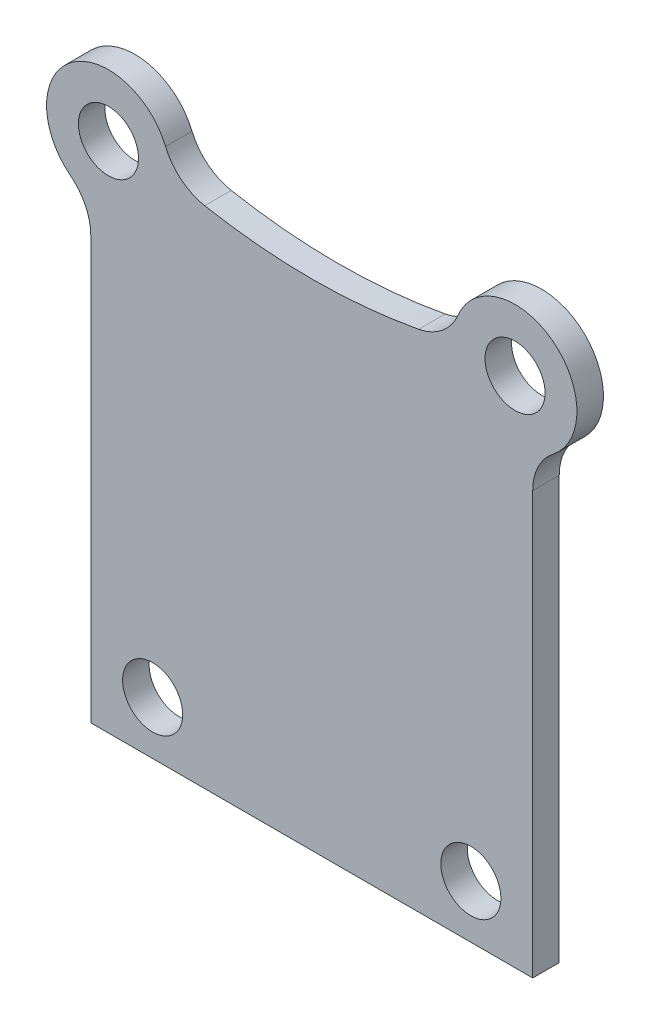
ISO-10303-21;
HEADER;
FILE_DESCRIPTION(('STEP AP214'),'2;1');
FILE_NAME('part.step','',(''),(''),'','','');
FILE_SCHEMA(('AUTOMOTIVE_DESIGN { 1 0 10303 214 1 1 1 1 }'));
ENDSEC;
DATA;
#1=APPLICATION_CONTEXT('core data for automotive mechanical design processes');
#2=APPLICATION_PROTOCOL_DEFINITION('international standard','automotive_design',2000,#1);
#3=PRODUCT_CONTEXT('',#1,'mechanical');
#4=PRODUCT('Part','Part','',(#3));
#5=PRODUCT_RELATED_PRODUCT_CATEGORY('part','',(#4));
#6=PRODUCT_DEFINITION_FORMATION('','',#4);
#7=PRODUCT_DEFINITION_CONTEXT('part definition',#1,'design');
#8=PRODUCT_DEFINITION('design','',#6,#7);
#9=PRODUCT_DEFINITION_SHAPE('','',#8);
#10=(LENGTH_UNIT() NAMED_UNIT(*) SI_UNIT(.MILLI.,.METRE.));
#11=(NAMED_UNIT(*) PLANE_ANGLE_UNIT() SI_UNIT($,.RADIAN.));
#12=(NAMED_UNIT(*) SI_UNIT($,.STERADIAN.) SOLID_ANGLE_UNIT());
#13=UNCERTAINTY_MEASURE_WITH_UNIT(LENGTH_MEASURE(1.E-05),#10,'distance_accuracy_value','');
#14=(GEOMETRIC_REPRESENTATION_CONTEXT(3) GLOBAL_UNCERTAINTY_ASSIGNED_CONTEXT((#13)) GLOBAL_UNIT_ASSIGNED_CONTEXT((#10,
#11,#12)) REPRESENTATION_CONTEXT('',''));
#15=CARTESIAN_POINT('',(0.,0.,0.));
#16=DIRECTION('',(0.,0.,1.));
#17=DIRECTION('',(1.,0.,0.));
#18=AXIS2_PLACEMENT_3D('',#15,#16,#17);
#19=CARTESIAN_POINT('',(-15.5,-56.1234753829798,-1.5));
#20=DIRECTION('',(0.,0.,1.));
#21=DIRECTION('',(1.,0.,0.));
#22=AXIS2_PLACEMENT_3D('',#19,#20,#21);
#23=CYLINDRICAL_SURFACE('',#22,3.);
#24=CARTESIAN_POINT('',(-15.5,-56.1234753829798,0.));
#25=DIRECTION('',(0.,0.,-1.));
#26=DIRECTION('',(1.,0.,0.));
#27=AXIS2_PLACEMENT_3D('',#24,#25,#26);
#28=CIRCLE('',#27,3.);
#29=CARTESIAN_POINT('',(-13.6538461538462,-53.7587944369891,0.));
#30=VERTEX_POINT('',#29);
#31=CARTESIAN_POINT('',(-12.5,-56.1234753829798,0.));
#32=VERTEX_POINT('',#31);
#33=EDGE_CURVE('E144',#30,#32,#28,.T.);
#34=ORIENTED_EDGE('',*,*,#33,.F.);
#35=DIRECTION('',(0.,0.,1.));
#36=VECTOR('',#35,1.);
#37=CARTESIAN_POINT('',(-13.6538461538462,-53.7587944369891,-1.5));
#38=LINE('',#37,#36);
#39=CARTESIAN_POINT('',(-13.6538461538462,-53.7587944369891,-1.5));
#40=VERTEX_POINT('',#39);
#41=EDGE_CURVE('E11',#40,#30,#38,.T.);
#42=ORIENTED_EDGE('',*,*,#41,.F.);
#43=CARTESIAN_POINT('',(-15.5,-56.1234753829798,-1.5));
#44=DIRECTION('',(0.,0.,-1.));
#45=DIRECTION('',(1.,0.,0.));
#46=AXIS2_PLACEMENT_3D('',#43,#44,#45);
#47=CIRCLE('',#46,3.);
#48=CARTESIAN_POINT('',(-12.5,-56.1234753829798,-1.5));
#49=VERTEX_POINT('',#48);
#50=EDGE_CURVE('E171',#40,#49,#47,.T.);
#51=ORIENTED_EDGE('',*,*,#50,.T.);
#52=DIRECTION('',(0.,0.,1.));
#53=VECTOR('',#52,1.);
#54=CARTESIAN_POINT('',(-12.5,-56.1234753829798,-1.5));
#55=LINE('',#54,#53);
#56=EDGE_CURVE('E38',#49,#32,#55,.T.);
#57=ORIENTED_EDGE('',*,*,#56,.T.);
#58=EDGE_LOOP('',(#34,#42,#51,#57));
#59=FACE_BOUND('',#58,.T.);
#60=ADVANCED_FACE('F35',(#59),#23,.F.);
#61=CARTESIAN_POINT('',(-11.5,-51.,-1.5));
#62=DIRECTION('',(0.,0.,1.));
#63=DIRECTION('',(1.,0.,0.));
#64=AXIS2_PLACEMENT_3D('',#61,#62,#63);
#65=CYLINDRICAL_SURFACE('',#64,3.50000000000001);
#66=CARTESIAN_POINT('',(-11.5,-51.,0.));
#67=DIRECTION('',(0.,0.,1.));
#68=DIRECTION('',(1.,0.,0.));
#69=AXIS2_PLACEMENT_3D('',#66,#67,#68);
#70=CIRCLE('',#69,3.50000000000001);
#71=CARTESIAN_POINT('',(-8.27038440674473,-49.6510807586062,0.));
#72=VERTEX_POINT('',#71);
#73=EDGE_CURVE('E169',#72,#30,#70,.T.);
#74=ORIENTED_EDGE('',*,*,#73,.F.);
#75=DIRECTION('',(0.,0.,1.));
#76=VECTOR('',#75,1.);
#77=CARTESIAN_POINT('',(-8.27038440674473,-49.6510807586062,-1.5));
#78=LINE('',#77,#76);
#79=CARTESIAN_POINT('',(-8.27038440674473,-49.6510807586062,-1.5));
#80=VERTEX_POINT('',#79);
#81=EDGE_CURVE('E44',#80,#72,#78,.T.);
#82=ORIENTED_EDGE('',*,*,#81,.F.);
#83=CARTESIAN_POINT('',(-11.5,-51.,-1.5));
#84=DIRECTION('',(0.,0.,1.));
#85=DIRECTION('',(1.,0.,0.));
#86=AXIS2_PLACEMENT_3D('',#83,#84,#85);
#87=CIRCLE('',#86,3.50000000000001);
#88=EDGE_CURVE('E134',#80,#40,#87,.T.);
#89=ORIENTED_EDGE('',*,*,#88,.T.);
#90=ORIENTED_EDGE('',*,*,#41,.T.);
#91=EDGE_LOOP('',(#74,#82,#89,#90));
#92=FACE_BOUND('',#91,.T.);
#93=ADVANCED_FACE('F187',(#92),#65,.T.);
#94=CARTESIAN_POINT('',(-5.50214246966879,-48.494864265983,-1.5));
#95=DIRECTION('',(0.,0.,1.));
#96=DIRECTION('',(1.,0.,0.));
#97=AXIS2_PLACEMENT_3D('',#94,#95,#96);
#98=CYLINDRICAL_SURFACE('',#97,3.);
#99=CARTESIAN_POINT('',(-5.50214246966879,-48.494864265983,0.));
#100=DIRECTION('',(0.,0.,-1.));
#101=DIRECTION('',(1.,0.,0.));
#102=AXIS2_PLACEMENT_3D('',#99,#100,#101);
#103=CIRCLE('',#102,3.);
#104=CARTESIAN_POINT('',(-6.05228930032564,-51.4439892997376,0.));
#105=VERTEX_POINT('',#104);
#106=EDGE_CURVE('E121',#105,#72,#103,.T.);
#107=ORIENTED_EDGE('',*,*,#106,.F.);
#108=DIRECTION('',(0.,0.,1.));
#109=VECTOR('',#108,1.);
#110=CARTESIAN_POINT('',(-6.05228930032564,-51.4439892997376,-1.5));
#111=LINE('',#110,#109);
#112=CARTESIAN_POINT('',(-6.05228930032564,-51.4439892997376,-1.5));
#113=VERTEX_POINT('',#112);
#114=EDGE_CURVE('E116',#113,#105,#111,.T.);
#115=ORIENTED_EDGE('',*,*,#114,.F.);
#116=CARTESIAN_POINT('',(-5.50214246966879,-48.494864265983,-1.5));
#117=DIRECTION('',(0.,0.,-1.));
#118=DIRECTION('',(1.,0.,0.));
#119=AXIS2_PLACEMENT_3D('',#116,#117,#118);
#120=CIRCLE('',#119,3.);
#121=EDGE_CURVE('E119',#113,#80,#120,.T.);
#122=ORIENTED_EDGE('',*,*,#121,.T.);
#123=ORIENTED_EDGE('',*,*,#81,.T.);
#124=EDGE_LOOP('',(#107,#115,#122,#123));
#125=FACE_BOUND('',#124,.T.);
#126=ADVANCED_FACE('F118',(#125),#98,.F.);
#127=CARTESIAN_POINT('',(0.,-19.,-1.5));
#128=DIRECTION('',(0.,0.,1.));
#129=DIRECTION('',(1.,0.,0.));
#130=AXIS2_PLACEMENT_3D('',#127,#128,#129);
#131=CYLINDRICAL_SURFACE('',#130,33.0036762718386);
#132=CARTESIAN_POINT('',(0.,-19.,0.));
#133=DIRECTION('',(0.,0.,-1.));
#134=DIRECTION('',(1.,0.,0.));
#135=AXIS2_PLACEMENT_3D('',#132,#133,#134);
#136=CIRCLE('',#135,33.0036762718386);
#137=CARTESIAN_POINT('',(6.05228930032564,-51.4439892997376,0.));
#138=VERTEX_POINT('',#137);
#139=EDGE_CURVE('E166',#138,#105,#136,.T.);
#140=ORIENTED_EDGE('',*,*,#139,.F.);
#141=DIRECTION('',(0.,0.,1.));
#142=VECTOR('',#141,1.);
#143=CARTESIAN_POINT('',(6.05228930032564,-51.4439892997376,-1.5));
#144=LINE('',#143,#142);
#145=CARTESIAN_POINT('',(6.05228930032564,-51.4439892997376,-1.5));
#146=VERTEX_POINT('',#145);
#147=EDGE_CURVE('E126',#146,#138,#144,.T.);
#148=ORIENTED_EDGE('',*,*,#147,.F.);
#149=CARTESIAN_POINT('',(0.,-19.,-1.5));
#150=DIRECTION('',(0.,0.,-1.));
#151=DIRECTION('',(1.,0.,0.));
#152=AXIS2_PLACEMENT_3D('',#149,#150,#151);
#153=CIRCLE('',#152,33.0036762718386);
#154=EDGE_CURVE('E132',#146,#113,#153,.T.);
#155=ORIENTED_EDGE('',*,*,#154,.T.);
#156=ORIENTED_EDGE('',*,*,#114,.T.);
#157=EDGE_LOOP('',(#140,#148,#155,#156));
#158=FACE_BOUND('',#157,.T.);
#159=ADVANCED_FACE('F136',(#158),#131,.F.);
#160=CARTESIAN_POINT('',(5.50214246966878,-48.494864265983,-1.5));
#161=DIRECTION('',(0.,0.,1.));
#162=DIRECTION('',(1.,0.,0.));
#163=AXIS2_PLACEMENT_3D('',#160,#161,#162);
#164=CYLINDRICAL_SURFACE('',#163,3.);
#165=CARTESIAN_POINT('',(5.50214246966878,-48.494864265983,0.));
#166=DIRECTION('',(0.,0.,-1.));
#167=DIRECTION('',(1.,0.,0.));
#168=AXIS2_PLACEMENT_3D('',#165,#166,#167);
#169=CIRCLE('',#168,3.);
#170=CARTESIAN_POINT('',(8.27038440674472,-49.6510807586062,0.));
#171=VERTEX_POINT('',#170);
#172=EDGE_CURVE('E163',#171,#138,#169,.T.);
#173=ORIENTED_EDGE('',*,*,#172,.F.);
#174=DIRECTION('',(0.,0.,1.));
#175=VECTOR('',#174,1.);
#176=CARTESIAN_POINT('',(8.27038440674472,-49.6510807586062,-1.5));
#177=LINE('',#176,#175);
#178=CARTESIAN_POINT('',(8.27038440674472,-49.6510807586062,-1.5));
#179=VERTEX_POINT('',#178);
#180=EDGE_CURVE('E175',#179,#171,#177,.T.);
#181=ORIENTED_EDGE('',*,*,#180,.F.);
#182=CARTESIAN_POINT('',(5.50214246966878,-48.494864265983,-1.5));
#183=DIRECTION('',(0.,0.,-1.));
#184=DIRECTION('',(1.,0.,0.));
#185=AXIS2_PLACEMENT_3D('',#182,#183,#184);
#186=CIRCLE('',#185,3.);
#187=EDGE_CURVE('E137',#179,#146,#186,.T.);
#188=ORIENTED_EDGE('',*,*,#187,.T.);
#189=ORIENTED_EDGE('',*,*,#147,.T.);
#190=EDGE_LOOP('',(#173,#181,#188,#189));
#191=FACE_BOUND('',#190,.T.);
#192=ADVANCED_FACE('F200',(#191),#164,.F.);
#193=CARTESIAN_POINT('',(11.5,-51.,-1.5));
#194=DIRECTION('',(0.,0.,1.));
#195=DIRECTION('',(1.,0.,0.));
#196=AXIS2_PLACEMENT_3D('',#193,#194,#195);
#197=CYLINDRICAL_SURFACE('',#196,3.5);
#198=CARTESIAN_POINT('',(11.5,-51.,0.));
#199=DIRECTION('',(0.,0.,1.));
#200=DIRECTION('',(1.,0.,0.));
#201=AXIS2_PLACEMENT_3D('',#198,#199,#200);
#202=CIRCLE('',#201,3.5);
#203=CARTESIAN_POINT('',(13.6538461538462,-53.7587944369891,0.));
#204=VERTEX_POINT('',#203);
#205=EDGE_CURVE('E160',#204,#171,#202,.T.);
#206=ORIENTED_EDGE('',*,*,#205,.F.);
#207=DIRECTION('',(0.,0.,1.));
#208=VECTOR('',#207,1.);
#209=CARTESIAN_POINT('',(13.6538461538462,-53.7587944369891,-1.5));
#210=LINE('',#209,#208);
#211=CARTESIAN_POINT('',(13.6538461538462,-53.7587944369891,-1.5));
#212=VERTEX_POINT('',#211);
#213=EDGE_CURVE('E177',#212,#204,#210,.T.);
#214=ORIENTED_EDGE('',*,*,#213,.F.);
#215=CARTESIAN_POINT('',(11.5,-51.,-1.5));
#216=DIRECTION('',(0.,0.,1.));
#217=DIRECTION('',(1.,0.,0.));
#218=AXIS2_PLACEMENT_3D('',#215,#216,#217);
#219=CIRCLE('',#218,3.5);
#220=EDGE_CURVE('E139',#212,#179,#219,.T.);
#221=ORIENTED_EDGE('',*,*,#220,.T.);
#222=ORIENTED_EDGE('',*,*,#180,.T.);
#223=EDGE_LOOP('',(#206,#214,#221,#222));
#224=FACE_BOUND('',#223,.T.);
#225=ADVANCED_FACE('F203',(#224),#197,.T.);
#226=CARTESIAN_POINT('',(15.5,-56.1234753829798,-1.5));
#227=DIRECTION('',(0.,0.,1.));
#228=DIRECTION('',(1.,0.,0.));
#229=AXIS2_PLACEMENT_3D('',#226,#227,#228);
#230=CYLINDRICAL_SURFACE('',#229,3.);
#231=CARTESIAN_POINT('',(15.5,-56.1234753829798,0.));
#232=DIRECTION('',(0.,0.,-1.));
#233=DIRECTION('',(1.,0.,0.));
#234=AXIS2_PLACEMENT_3D('',#231,#232,#233);
#235=CIRCLE('',#234,3.);
#236=CARTESIAN_POINT('',(12.5,-56.1234753829798,0.));
#237=VERTEX_POINT('',#236);
#238=EDGE_CURVE('E157',#237,#204,#235,.T.);
#239=ORIENTED_EDGE('',*,*,#238,.F.);
#240=DIRECTION('',(0.,0.,1.));
#241=VECTOR('',#240,1.);
#242=CARTESIAN_POINT('',(12.5,-56.1234753829798,-1.5));
#243=LINE('',#242,#241);
#244=CARTESIAN_POINT('',(12.5,-56.1234753829798,-1.5));
#245=VERTEX_POINT('',#244);
#246=EDGE_CURVE('E179',#245,#237,#243,.T.);
#247=ORIENTED_EDGE('',*,*,#246,.F.);
#248=CARTESIAN_POINT('',(15.5,-56.1234753829798,-1.5));
#249=DIRECTION('',(0.,0.,-1.));
#250=DIRECTION('',(1.,0.,0.));
#251=AXIS2_PLACEMENT_3D('',#248,#249,#250);
#252=CIRCLE('',#251,3.);
#253=EDGE_CURVE('E283',#245,#212,#252,.T.);
#254=ORIENTED_EDGE('',*,*,#253,.T.);
#255=ORIENTED_EDGE('',*,*,#213,.T.);
#256=EDGE_LOOP('',(#239,#247,#254,#255));
#257=FACE_BOUND('',#256,.T.);
#258=ADVANCED_FACE('F207',(#257),#230,.F.);
#259=CARTESIAN_POINT('',(12.5,-80.,-1.5));
#260=DIRECTION('',(1.,0.,0.));
#261=DIRECTION('',(0.,1.,0.));
#262=AXIS2_PLACEMENT_3D('',#259,#260,#261);
#263=PLANE('',#262);
#264=DIRECTION('',(0.,1.,0.));
#265=VECTOR('',#264,1.);
#266=CARTESIAN_POINT('',(12.5,-80.,0.));
#267=LINE('',#266,#265);
#268=CARTESIAN_POINT('',(12.5,-80.,0.));
#269=VERTEX_POINT('',#268);
#270=EDGE_CURVE('E154',#269,#237,#267,.T.);
#271=ORIENTED_EDGE('',*,*,#270,.F.);
#272=DIRECTION('',(0.,0.,1.));
#273=VECTOR('',#272,1.);
#274=CARTESIAN_POINT('',(12.5,-80.,-1.5));
#275=LINE('',#274,#273);
#276=CARTESIAN_POINT('',(12.5,-80.,-1.5));
#277=VERTEX_POINT('',#276);
#278=EDGE_CURVE('E181',#277,#269,#275,.T.);
#279=ORIENTED_EDGE('',*,*,#278,.F.);
#280=DIRECTION('',(0.,1.,0.));
#281=VECTOR('',#280,1.);
#282=CARTESIAN_POINT('',(12.5,-80.,-1.5));
#283=LINE('',#282,#281);
#284=EDGE_CURVE('E280',#277,#245,#283,.T.);
#285=ORIENTED_EDGE('',*,*,#284,.T.);
#286=ORIENTED_EDGE('',*,*,#246,.T.);
#287=EDGE_LOOP('',(#271,#279,#285,#286));
#288=FACE_BOUND('',#287,.T.);
#289=ADVANCED_FACE('F211',(#288),#263,.T.);
#290=CARTESIAN_POINT('',(-12.5,-80.,-1.5));
#291=DIRECTION('',(0.,-1.,0.));
#292=DIRECTION('',(0.,0.,-1.));
#293=AXIS2_PLACEMENT_3D('',#290,#291,#292);
#294=PLANE('',#293);
#295=DIRECTION('',(1.,0.,0.));
#296=VECTOR('',#295,1.);
#297=CARTESIAN_POINT('',(-12.5,-80.,0.));
#298=LINE('',#297,#296);
#299=CARTESIAN_POINT('',(-12.5,-80.,0.));
#300=VERTEX_POINT('',#299);
#301=EDGE_CURVE('E151',#300,#269,#298,.T.);
#302=ORIENTED_EDGE('',*,*,#301,.F.);
#303=DIRECTION('',(0.,0.,1.));
#304=VECTOR('',#303,1.);
#305=CARTESIAN_POINT('',(-12.5,-80.,-1.5));
#306=LINE('',#305,#304);
#307=CARTESIAN_POINT('',(-12.5,-80.,-1.5));
#308=VERTEX_POINT('',#307);
#309=EDGE_CURVE('E182',#308,#300,#306,.T.);
#310=ORIENTED_EDGE('',*,*,#309,.F.);
#311=DIRECTION('',(1.,0.,0.));
#312=VECTOR('',#311,1.);
#313=CARTESIAN_POINT('',(-12.5,-80.,-1.5));
#314=LINE('',#313,#312);
#315=EDGE_CURVE('E277',#308,#277,#314,.T.);
#316=ORIENTED_EDGE('',*,*,#315,.T.);
#317=ORIENTED_EDGE('',*,*,#278,.T.);
#318=EDGE_LOOP('',(#302,#310,#316,#317));
#319=FACE_BOUND('',#318,.T.);
#320=ADVANCED_FACE('F215',(#319),#294,.T.);
#321=CARTESIAN_POINT('',(-12.5,-56.1234753829798,-1.5));
#322=DIRECTION('',(-1.,0.,0.));
#323=DIRECTION('',(0.,0.,1.));
#324=AXIS2_PLACEMENT_3D('',#321,#322,#323);
#325=PLANE('',#324);
#326=DIRECTION('',(0.,-1.,0.));
#327=VECTOR('',#326,1.);
#328=CARTESIAN_POINT('',(-12.5,-56.1234753829798,0.));
#329=LINE('',#328,#327);
#330=EDGE_CURVE('E147',#32,#300,#329,.T.);
#331=ORIENTED_EDGE('',*,*,#330,.F.);
#332=ORIENTED_EDGE('',*,*,#56,.F.);
#333=DIRECTION('',(0.,-1.,0.));
#334=VECTOR('',#333,1.);
#335=CARTESIAN_POINT('',(-12.5,-56.1234753829798,-1.5));
#336=LINE('',#335,#334);
#337=EDGE_CURVE('E275',#49,#308,#336,.T.);
#338=ORIENTED_EDGE('',*,*,#337,.T.);
#339=ORIENTED_EDGE('',*,*,#309,.T.);
#340=EDGE_LOOP('',(#331,#332,#338,#339));
#341=FACE_BOUND('',#340,.T.);
#342=ADVANCED_FACE('F184',(#341),#325,.T.);
#343=CARTESIAN_POINT('',(-15.5,-56.1234753829798,-1.5));
#344=DIRECTION('',(0.,0.,1.));
#345=DIRECTION('',(1.,0.,0.));
#346=AXIS2_PLACEMENT_3D('',#343,#344,#345);
#347=PLANE('',#346);
#348=CARTESIAN_POINT('',(11.5,-51.,-1.5));
#349=DIRECTION('',(0.,0.,1.));
#350=DIRECTION('',(1.,0.,0.));
#351=AXIS2_PLACEMENT_3D('',#348,#349,#350);
#352=CIRCLE('',#351,1.69999999999999);
#353=CARTESIAN_POINT('',(13.2,-51.,-1.5));
#354=VERTEX_POINT('',#353);
#355=EDGE_CURVE('E250',#354,#354,#352,.T.);
#356=ORIENTED_EDGE('',*,*,#355,.T.);
#357=EDGE_LOOP('',(#356));
#358=FACE_BOUND('',#357,.T.);
#359=CARTESIAN_POINT('',(-11.5,-51.,-1.5));
#360=DIRECTION('',(0.,0.,1.));
#361=DIRECTION('',(1.,0.,0.));
#362=AXIS2_PLACEMENT_3D('',#359,#360,#361);
#363=CIRCLE('',#362,1.69999999999999);
#364=CARTESIAN_POINT('',(-9.80000000000001,-51.,-1.5));
#365=VERTEX_POINT('',#364);
#366=EDGE_CURVE('E260',#365,#365,#363,.T.);
#367=ORIENTED_EDGE('',*,*,#366,.T.);
#368=EDGE_LOOP('',(#367));
#369=FACE_BOUND('',#368,.T.);
#370=CARTESIAN_POINT('',(9.,-77.,-1.5));
#371=DIRECTION('',(0.,0.,1.));
#372=DIRECTION('',(1.,0.,0.));
#373=AXIS2_PLACEMENT_3D('',#370,#371,#372);
#374=CIRCLE('',#373,1.69999999999999);
#375=CARTESIAN_POINT('',(10.7,-77.,-1.5));
#376=VERTEX_POINT('',#375);
#377=EDGE_CURVE('E266',#376,#376,#374,.T.);
#378=ORIENTED_EDGE('',*,*,#377,.T.);
#379=EDGE_LOOP('',(#378));
#380=FACE_BOUND('',#379,.T.);
#381=CARTESIAN_POINT('',(-9.00000000000001,-77.,-1.5));
#382=DIRECTION('',(0.,0.,1.));
#383=DIRECTION('',(1.,0.,0.));
#384=AXIS2_PLACEMENT_3D('',#381,#382,#383);
#385=CIRCLE('',#384,1.69999999999999);
#386=CARTESIAN_POINT('',(-7.30000000000001,-77.,-1.5));
#387=VERTEX_POINT('',#386);
#388=EDGE_CURVE('E148',#387,#387,#385,.T.);
#389=ORIENTED_EDGE('',*,*,#388,.T.);
#390=EDGE_LOOP('',(#389));
#391=FACE_BOUND('',#390,.T.);
#392=ORIENTED_EDGE('',*,*,#50,.F.);
#393=ORIENTED_EDGE('',*,*,#88,.F.);
#394=ORIENTED_EDGE('',*,*,#121,.F.);
#395=ORIENTED_EDGE('',*,*,#154,.F.);
#396=ORIENTED_EDGE('',*,*,#187,.F.);
#397=ORIENTED_EDGE('',*,*,#220,.F.);
#398=ORIENTED_EDGE('',*,*,#253,.F.);
#399=ORIENTED_EDGE('',*,*,#284,.F.);
#400=ORIENTED_EDGE('',*,*,#315,.F.);
#401=ORIENTED_EDGE('',*,*,#337,.F.);
#402=EDGE_LOOP('',(#392,#393,#394,#395,#396,#397,#398,#399,#400,#401));
#403=FACE_BOUND('',#402,.T.);
#404=ADVANCED_FACE('F130',(#358,#369,#380,#391,#403),#347,.F.);
#405=CARTESIAN_POINT('',(-15.5,-56.1234753829798,0.));
#406=DIRECTION('',(0.,0.,1.));
#407=DIRECTION('',(1.,0.,0.));
#408=AXIS2_PLACEMENT_3D('',#405,#406,#407);
#409=PLANE('',#408);
#410=CARTESIAN_POINT('',(11.5,-51.,0.));
#411=DIRECTION('',(0.,0.,1.));
#412=DIRECTION('',(1.,0.,0.));
#413=AXIS2_PLACEMENT_3D('',#410,#411,#412);
#414=CIRCLE('',#413,1.69999999999999);
#415=CARTESIAN_POINT('',(13.2,-51.,0.));
#416=VERTEX_POINT('',#415);
#417=EDGE_CURVE('E253',#416,#416,#414,.T.);
#418=ORIENTED_EDGE('',*,*,#417,.F.);
#419=EDGE_LOOP('',(#418));
#420=FACE_BOUND('',#419,.T.);
#421=CARTESIAN_POINT('',(-11.5,-51.,0.));
#422=DIRECTION('',(0.,0.,1.));
#423=DIRECTION('',(1.,0.,0.));
#424=AXIS2_PLACEMENT_3D('',#421,#422,#423);
#425=CIRCLE('',#424,1.69999999999999);
#426=CARTESIAN_POINT('',(-9.80000000000001,-51.,0.));
#427=VERTEX_POINT('',#426);
#428=EDGE_CURVE('E255',#427,#427,#425,.T.);
#429=ORIENTED_EDGE('',*,*,#428,.F.);
#430=EDGE_LOOP('',(#429));
#431=FACE_BOUND('',#430,.T.);
#432=CARTESIAN_POINT('',(9.,-77.,0.));
#433=DIRECTION('',(0.,0.,1.));
#434=DIRECTION('',(1.,0.,0.));
#435=AXIS2_PLACEMENT_3D('',#432,#433,#434);
#436=CIRCLE('',#435,1.69999999999999);
#437=CARTESIAN_POINT('',(10.7,-77.,0.));
#438=VERTEX_POINT('',#437);
#439=EDGE_CURVE('E263',#438,#438,#436,.T.);
#440=ORIENTED_EDGE('',*,*,#439,.F.);
#441=EDGE_LOOP('',(#440));
#442=FACE_BOUND('',#441,.T.);
#443=CARTESIAN_POINT('',(-9.00000000000001,-77.,0.));
#444=DIRECTION('',(0.,0.,1.));
#445=DIRECTION('',(1.,0.,0.));
#446=AXIS2_PLACEMENT_3D('',#443,#444,#445);
#447=CIRCLE('',#446,1.69999999999999);
#448=CARTESIAN_POINT('',(-7.30000000000002,-77.,0.));
#449=VERTEX_POINT('',#448);
#450=EDGE_CURVE('E269',#449,#449,#447,.T.);
#451=ORIENTED_EDGE('',*,*,#450,.F.);
#452=EDGE_LOOP('',(#451));
#453=FACE_BOUND('',#452,.T.);
#454=ORIENTED_EDGE('',*,*,#33,.T.);
#455=ORIENTED_EDGE('',*,*,#330,.T.);
#456=ORIENTED_EDGE('',*,*,#301,.T.);
#457=ORIENTED_EDGE('',*,*,#270,.T.);
#458=ORIENTED_EDGE('',*,*,#238,.T.);
#459=ORIENTED_EDGE('',*,*,#205,.T.);
#460=ORIENTED_EDGE('',*,*,#172,.T.);
#461=ORIENTED_EDGE('',*,*,#139,.T.);
#462=ORIENTED_EDGE('',*,*,#106,.T.);
#463=ORIENTED_EDGE('',*,*,#73,.T.);
#464=EDGE_LOOP('',(#454,#455,#456,#457,#458,#459,#460,#461,#462,#463));
#465=FACE_BOUND('',#464,.T.);
#466=ADVANCED_FACE('F186',(#420,#431,#442,#453,#465),#409,.T.);
#467=CARTESIAN_POINT('',(-9.00000000000001,-77.,0.));
#468=DIRECTION('',(0.,0.,1.));
#469=DIRECTION('',(1.,0.,0.));
#470=AXIS2_PLACEMENT_3D('',#467,#468,#469);
#471=CYLINDRICAL_SURFACE('',#470,1.69999999999999);
#472=ORIENTED_EDGE('',*,*,#388,.F.);
#473=EDGE_LOOP('',(#472));
#474=FACE_BOUND('',#473,.T.);
#475=ORIENTED_EDGE('',*,*,#450,.T.);
#476=EDGE_LOOP('',(#475));
#477=FACE_BOUND('',#476,.T.);
#478=ADVANCED_FACE('F227',(#474,#477),#471,.F.);
#479=CARTESIAN_POINT('',(9.,-77.,0.));
#480=DIRECTION('',(0.,0.,1.));
#481=DIRECTION('',(1.,0.,0.));
#482=AXIS2_PLACEMENT_3D('',#479,#480,#481);
#483=CYLINDRICAL_SURFACE('',#482,1.69999999999999);
#484=ORIENTED_EDGE('',*,*,#377,.F.);
#485=EDGE_LOOP('',(#484));
#486=FACE_BOUND('',#485,.T.);
#487=ORIENTED_EDGE('',*,*,#439,.T.);
#488=EDGE_LOOP('',(#487));
#489=FACE_BOUND('',#488,.T.);
#490=ADVANCED_FACE('F234',(#486,#489),#483,.F.);
#491=CARTESIAN_POINT('',(-11.5,-51.,0.));
#492=DIRECTION('',(0.,0.,1.));
#493=DIRECTION('',(1.,0.,0.));
#494=AXIS2_PLACEMENT_3D('',#491,#492,#493);
#495=CYLINDRICAL_SURFACE('',#494,1.69999999999999);
#496=ORIENTED_EDGE('',*,*,#366,.F.);
#497=EDGE_LOOP('',(#496));
#498=FACE_BOUND('',#497,.T.);
#499=ORIENTED_EDGE('',*,*,#428,.T.);
#500=EDGE_LOOP('',(#499));
#501=FACE_BOUND('',#500,.T.);
#502=ADVANCED_FACE('F238',(#498,#501),#495,.F.);
#503=CARTESIAN_POINT('',(11.5,-51.,0.));
#504=DIRECTION('',(0.,0.,1.));
#505=DIRECTION('',(1.,0.,0.));
#506=AXIS2_PLACEMENT_3D('',#503,#504,#505);
#507=CYLINDRICAL_SURFACE('',#506,1.69999999999999);
#508=ORIENTED_EDGE('',*,*,#355,.F.);
#509=EDGE_LOOP('',(#508));
#510=FACE_BOUND('',#509,.T.);
#511=ORIENTED_EDGE('',*,*,#417,.T.);
#512=EDGE_LOOP('',(#511));
#513=FACE_BOUND('',#512,.T.);
#514=ADVANCED_FACE('F242',(#510,#513),#507,.F.);
#515=CLOSED_SHELL('',(#60,#93,#126,#159,#192,#225,#258,#289,#320,#342,#404,#466,#478,#490,#502,#514));
#516=MANIFOLD_SOLID_BREP('B2',#515);
#517=ADVANCED_BREP_SHAPE_REPRESENTATION('',(#18,#516),#14);
#518=SHAPE_DEFINITION_REPRESENTATION(#9,#517);
ENDSEC;
END-ISO-10303-21;
